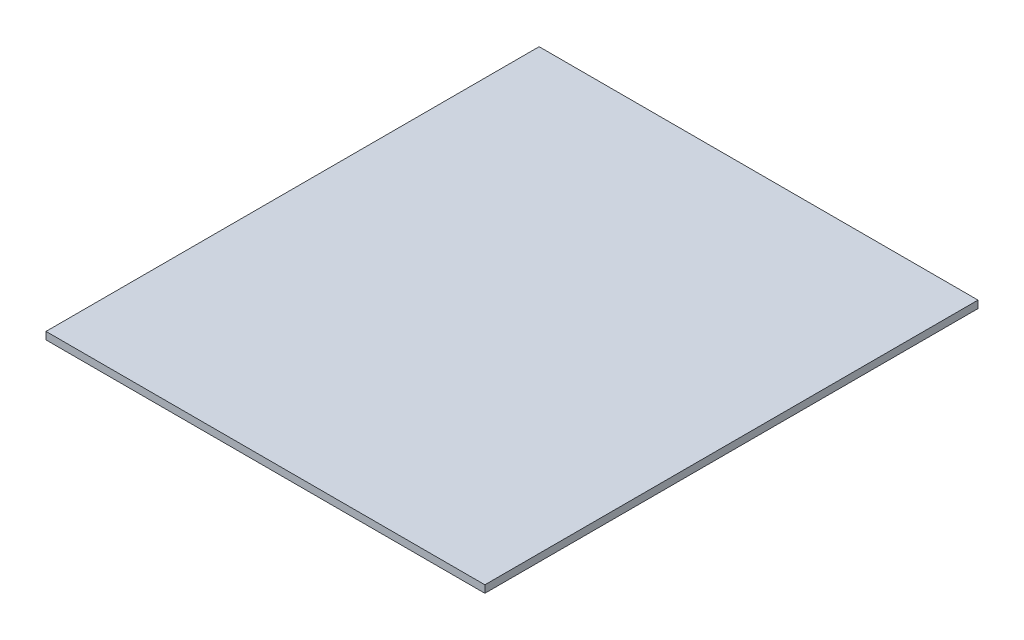
ISO-10303-21;
HEADER;
FILE_DESCRIPTION(('STEP AP214'),'2;1');
FILE_NAME('part.step','',(''),(''),'','','');
FILE_SCHEMA(('AUTOMOTIVE_DESIGN { 1 0 10303 214 1 1 1 1 }'));
ENDSEC;
DATA;
#1=APPLICATION_CONTEXT('core data for automotive mechanical design processes');
#2=APPLICATION_PROTOCOL_DEFINITION('international standard','automotive_design',2000,#1);
#3=PRODUCT_CONTEXT('',#1,'mechanical');
#4=PRODUCT('Part','Part','',(#3));
#5=PRODUCT_RELATED_PRODUCT_CATEGORY('part','',(#4));
#6=PRODUCT_DEFINITION_FORMATION('','',#4);
#7=PRODUCT_DEFINITION_CONTEXT('part definition',#1,'design');
#8=PRODUCT_DEFINITION('design','',#6,#7);
#9=PRODUCT_DEFINITION_SHAPE('','',#8);
#10=(LENGTH_UNIT() NAMED_UNIT(*) SI_UNIT(.MILLI.,.METRE.));
#11=(NAMED_UNIT(*) PLANE_ANGLE_UNIT() SI_UNIT($,.RADIAN.));
#12=(NAMED_UNIT(*) SI_UNIT($,.STERADIAN.) SOLID_ANGLE_UNIT());
#13=UNCERTAINTY_MEASURE_WITH_UNIT(LENGTH_MEASURE(1.E-05),#10,'distance_accuracy_value','');
#14=(GEOMETRIC_REPRESENTATION_CONTEXT(3) GLOBAL_UNCERTAINTY_ASSIGNED_CONTEXT((#13)) GLOBAL_UNIT_ASSIGNED_CONTEXT((#10,
#11,#12)) REPRESENTATION_CONTEXT('',''));
#15=CARTESIAN_POINT('',(0.,0.,0.));
#16=DIRECTION('',(0.,0.,1.));
#17=DIRECTION('',(1.,0.,0.));
#18=AXIS2_PLACEMENT_3D('',#15,#16,#17);
#19=CARTESIAN_POINT('',(-89.,3.,-100.));
#20=DIRECTION('',(1.,0.,0.));
#21=DIRECTION('',(0.,0.,-1.));
#22=AXIS2_PLACEMENT_3D('',#19,#20,#21);
#23=PLANE('',#22);
#24=DIRECTION('',(0.,0.,1.));
#25=VECTOR('',#24,1.);
#26=CARTESIAN_POINT('',(-89.,0.,-100.));
#27=LINE('',#26,#25);
#28=CARTESIAN_POINT('',(-89.,0.,-100.));
#29=VERTEX_POINT('',#28);
#30=CARTESIAN_POINT('',(-89.,0.,100.));
#31=VERTEX_POINT('',#30);
#32=EDGE_CURVE('E96',#29,#31,#27,.T.);
#33=ORIENTED_EDGE('',*,*,#32,.T.);
#34=DIRECTION('',(0.,-1.,0.));
#35=VECTOR('',#34,1.);
#36=CARTESIAN_POINT('',(-89.,3.,100.));
#37=LINE('',#36,#35);
#38=CARTESIAN_POINT('',(-89.,3.,100.));
#39=VERTEX_POINT('',#38);
#40=EDGE_CURVE('E11',#39,#31,#37,.T.);
#41=ORIENTED_EDGE('',*,*,#40,.F.);
#42=DIRECTION('',(0.,0.,1.));
#43=VECTOR('',#42,1.);
#44=CARTESIAN_POINT('',(-89.,3.,-100.));
#45=LINE('',#44,#43);
#46=CARTESIAN_POINT('',(-89.,3.,-100.));
#47=VERTEX_POINT('',#46);
#48=EDGE_CURVE('E84',#47,#39,#45,.T.);
#49=ORIENTED_EDGE('',*,*,#48,.F.);
#50=DIRECTION('',(0.,-1.,0.));
#51=VECTOR('',#50,1.);
#52=CARTESIAN_POINT('',(-89.,3.,-100.));
#53=LINE('',#52,#51);
#54=EDGE_CURVE('E92',#47,#29,#53,.T.);
#55=ORIENTED_EDGE('',*,*,#54,.T.);
#56=EDGE_LOOP('',(#33,#41,#49,#55));
#57=FACE_BOUND('',#56,.T.);
#58=ADVANCED_FACE('F33',(#57),#23,.F.);
#59=CARTESIAN_POINT('',(-89.,3.,100.));
#60=DIRECTION('',(0.,0.,-1.));
#61=DIRECTION('',(-1.,0.,0.));
#62=AXIS2_PLACEMENT_3D('',#59,#60,#61);
#63=PLANE('',#62);
#64=DIRECTION('',(1.,0.,0.));
#65=VECTOR('',#64,1.);
#66=CARTESIAN_POINT('',(-89.,0.,100.));
#67=LINE('',#66,#65);
#68=CARTESIAN_POINT('',(89.,0.,100.));
#69=VERTEX_POINT('',#68);
#70=EDGE_CURVE('E88',#31,#69,#67,.T.);
#71=ORIENTED_EDGE('',*,*,#70,.T.);
#72=DIRECTION('',(0.,-1.,0.));
#73=VECTOR('',#72,1.);
#74=CARTESIAN_POINT('',(89.,3.,100.));
#75=LINE('',#74,#73);
#76=CARTESIAN_POINT('',(89.,3.,100.));
#77=VERTEX_POINT('',#76);
#78=EDGE_CURVE('E41',#77,#69,#75,.T.);
#79=ORIENTED_EDGE('',*,*,#78,.F.);
#80=DIRECTION('',(1.,0.,0.));
#81=VECTOR('',#80,1.);
#82=CARTESIAN_POINT('',(-89.,3.,100.));
#83=LINE('',#82,#81);
#84=EDGE_CURVE('E79',#39,#77,#83,.T.);
#85=ORIENTED_EDGE('',*,*,#84,.F.);
#86=ORIENTED_EDGE('',*,*,#40,.T.);
#87=EDGE_LOOP('',(#71,#79,#85,#86));
#88=FACE_BOUND('',#87,.T.);
#89=ADVANCED_FACE('F87',(#88),#63,.F.);
#90=CARTESIAN_POINT('',(89.,3.,-100.));
#91=DIRECTION('',(-1.,0.,0.));
#92=DIRECTION('',(0.,0.,1.));
#93=AXIS2_PLACEMENT_3D('',#90,#91,#92);
#94=PLANE('',#93);
#95=DIRECTION('',(0.,0.,-1.));
#96=VECTOR('',#95,1.);
#97=CARTESIAN_POINT('',(89.,0.,-100.));
#98=LINE('',#97,#96);
#99=CARTESIAN_POINT('',(89.,0.,-100.));
#100=VERTEX_POINT('',#99);
#101=EDGE_CURVE('E66',#69,#100,#98,.T.);
#102=ORIENTED_EDGE('',*,*,#101,.T.);
#103=DIRECTION('',(0.,-1.,0.));
#104=VECTOR('',#103,1.);
#105=CARTESIAN_POINT('',(89.,3.,-100.));
#106=LINE('',#105,#104);
#107=CARTESIAN_POINT('',(89.,3.,-100.));
#108=VERTEX_POINT('',#107);
#109=EDGE_CURVE('E89',#108,#100,#106,.T.);
#110=ORIENTED_EDGE('',*,*,#109,.F.);
#111=DIRECTION('',(0.,0.,-1.));
#112=VECTOR('',#111,1.);
#113=CARTESIAN_POINT('',(89.,3.,-100.));
#114=LINE('',#113,#112);
#115=EDGE_CURVE('E82',#77,#108,#114,.T.);
#116=ORIENTED_EDGE('',*,*,#115,.F.);
#117=ORIENTED_EDGE('',*,*,#78,.T.);
#118=EDGE_LOOP('',(#102,#110,#116,#117));
#119=FACE_BOUND('',#118,.T.);
#120=ADVANCED_FACE('F90',(#119),#94,.F.);
#121=CARTESIAN_POINT('',(-89.,3.,-100.));
#122=DIRECTION('',(0.,0.,1.));
#123=DIRECTION('',(1.,0.,0.));
#124=AXIS2_PLACEMENT_3D('',#121,#122,#123);
#125=PLANE('',#124);
#126=DIRECTION('',(-1.,0.,0.));
#127=VECTOR('',#126,1.);
#128=CARTESIAN_POINT('',(-89.,0.,-100.));
#129=LINE('',#128,#127);
#130=EDGE_CURVE('E72',#100,#29,#129,.T.);
#131=ORIENTED_EDGE('',*,*,#130,.T.);
#132=ORIENTED_EDGE('',*,*,#54,.F.);
#133=DIRECTION('',(-1.,0.,0.));
#134=VECTOR('',#133,1.);
#135=CARTESIAN_POINT('',(-89.,3.,-100.));
#136=LINE('',#135,#134);
#137=EDGE_CURVE('E49',#108,#47,#136,.T.);
#138=ORIENTED_EDGE('',*,*,#137,.F.);
#139=ORIENTED_EDGE('',*,*,#109,.T.);
#140=EDGE_LOOP('',(#131,#132,#138,#139));
#141=FACE_BOUND('',#140,.T.);
#142=ADVANCED_FACE('F103',(#141),#125,.F.);
#143=CARTESIAN_POINT('',(0.,3.,0.));
#144=DIRECTION('',(0.,1.,0.));
#145=DIRECTION('',(0.,0.,1.));
#146=AXIS2_PLACEMENT_3D('',#143,#144,#145);
#147=PLANE('',#146);
#148=ORIENTED_EDGE('',*,*,#48,.T.);
#149=ORIENTED_EDGE('',*,*,#84,.T.);
#150=ORIENTED_EDGE('',*,*,#115,.T.);
#151=ORIENTED_EDGE('',*,*,#137,.T.);
#152=EDGE_LOOP('',(#148,#149,#150,#151));
#153=FACE_BOUND('',#152,.T.);
#154=ADVANCED_FACE('F80',(#153),#147,.T.);
#155=CARTESIAN_POINT('',(0.,0.,0.));
#156=DIRECTION('',(0.,1.,0.));
#157=DIRECTION('',(0.,0.,1.));
#158=AXIS2_PLACEMENT_3D('',#155,#156,#157);
#159=PLANE('',#158);
#160=ORIENTED_EDGE('',*,*,#32,.F.);
#161=ORIENTED_EDGE('',*,*,#130,.F.);
#162=ORIENTED_EDGE('',*,*,#101,.F.);
#163=ORIENTED_EDGE('',*,*,#70,.F.);
#164=EDGE_LOOP('',(#160,#161,#162,#163));
#165=FACE_BOUND('',#164,.T.);
#166=ADVANCED_FACE('F106',(#165),#159,.F.);
#167=CLOSED_SHELL('',(#58,#89,#120,#142,#154,#166));
#168=MANIFOLD_SOLID_BREP('B2',#167);
#169=ADVANCED_BREP_SHAPE_REPRESENTATION('',(#18,#168),#14);
#170=SHAPE_DEFINITION_REPRESENTATION(#9,#169);
ENDSEC;
END-ISO-10303-21;
